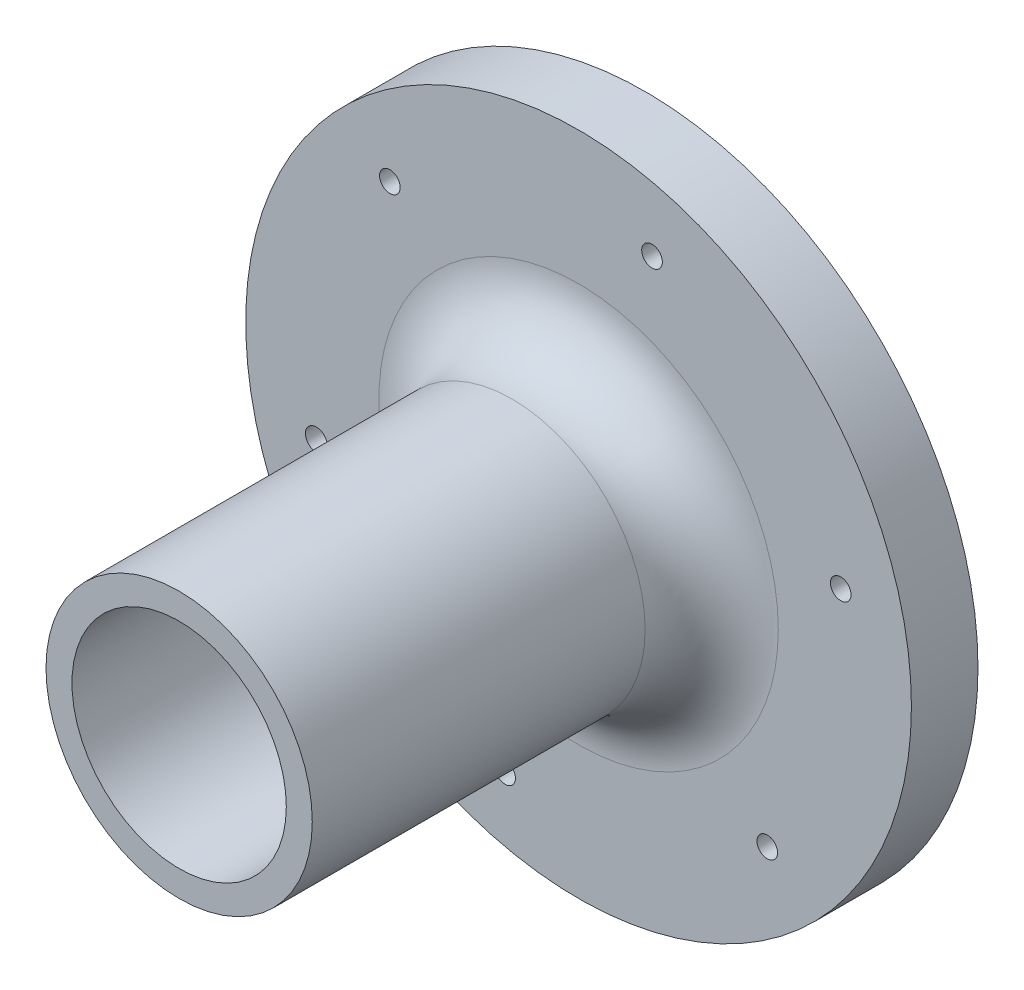
ISO-10303-21;
HEADER;
FILE_DESCRIPTION(('STEP AP214'),'2;1');
FILE_NAME('part.step','',(''),(''),'','','');
FILE_SCHEMA(('AUTOMOTIVE_DESIGN { 1 0 10303 214 1 1 1 1 }'));
ENDSEC;
DATA;
#1=APPLICATION_CONTEXT('core data for automotive mechanical design processes');
#2=APPLICATION_PROTOCOL_DEFINITION('international standard','automotive_design',2000,#1);
#3=PRODUCT_CONTEXT('',#1,'mechanical');
#4=PRODUCT('Part','Part','',(#3));
#5=PRODUCT_RELATED_PRODUCT_CATEGORY('part','',(#4));
#6=PRODUCT_DEFINITION_FORMATION('','',#4);
#7=PRODUCT_DEFINITION_CONTEXT('part definition',#1,'design');
#8=PRODUCT_DEFINITION('design','',#6,#7);
#9=PRODUCT_DEFINITION_SHAPE('','',#8);
#10=(LENGTH_UNIT() NAMED_UNIT(*) SI_UNIT(.MILLI.,.METRE.));
#11=(NAMED_UNIT(*) PLANE_ANGLE_UNIT() SI_UNIT($,.RADIAN.));
#12=(NAMED_UNIT(*) SI_UNIT($,.STERADIAN.) SOLID_ANGLE_UNIT());
#13=UNCERTAINTY_MEASURE_WITH_UNIT(LENGTH_MEASURE(1.E-05),#10,'distance_accuracy_value','');
#14=(GEOMETRIC_REPRESENTATION_CONTEXT(3) GLOBAL_UNCERTAINTY_ASSIGNED_CONTEXT((#13)) GLOBAL_UNIT_ASSIGNED_CONTEXT((#10,
#11,#12)) REPRESENTATION_CONTEXT('',''));
#15=CARTESIAN_POINT('',(0.,0.,0.));
#16=DIRECTION('',(0.,0.,1.));
#17=DIRECTION('',(1.,0.,0.));
#18=AXIS2_PLACEMENT_3D('',#15,#16,#17);
#19=CARTESIAN_POINT('',(0.,0.,10.));
#20=DIRECTION('',(0.,0.,1.));
#21=DIRECTION('',(1.,0.,0.));
#22=AXIS2_PLACEMENT_3D('',#19,#20,#21);
#23=PLANE('',#22);
#24=CARTESIAN_POINT('',(0.,0.,10.));
#25=DIRECTION('',(0.,0.,1.));
#26=DIRECTION('',(1.,0.,0.));
#27=AXIS2_PLACEMENT_3D('',#24,#25,#26);
#28=CIRCLE('',#27,30.);
#29=CARTESIAN_POINT('',(30.,0.,10.));
#30=VERTEX_POINT('',#29);
#31=EDGE_CURVE('E10',#30,#30,#28,.F.);
#32=ORIENTED_EDGE('',*,*,#31,.T.);
#33=EDGE_LOOP('',(#32));
#34=FACE_BOUND('',#33,.T.);
#35=CARTESIAN_POINT('',(39.3771859808202,9.99342156005784,10.));
#36=DIRECTION('',(0.,0.,1.));
#37=DIRECTION('',(1.,0.,0.));
#38=AXIS2_PLACEMENT_3D('',#35,#36,#37);
#39=CIRCLE('',#38,1.54999999999999);
#40=CARTESIAN_POINT('',(40.9271859808202,9.99342156005784,10.));
#41=VERTEX_POINT('',#40);
#42=EDGE_CURVE('E82',#41,#41,#39,.T.);
#43=ORIENTED_EDGE('',*,*,#42,.F.);
#44=EDGE_LOOP('',(#43));
#45=FACE_BOUND('',#44,.T.);
#46=CARTESIAN_POINT('',(-28.3431499322452,29.1049326089431,10.));
#47=DIRECTION('',(0.,0.,1.));
#48=DIRECTION('',(1.,0.,0.));
#49=AXIS2_PLACEMENT_3D('',#46,#47,#48);
#50=CIRCLE('',#49,1.55);
#51=CARTESIAN_POINT('',(-26.7931499322452,29.1049326089431,10.));
#52=VERTEX_POINT('',#51);
#53=EDGE_CURVE('E70',#52,#52,#50,.T.);
#54=ORIENTED_EDGE('',*,*,#53,.F.);
#55=EDGE_LOOP('',(#54));
#56=FACE_BOUND('',#55,.T.);
#57=CARTESIAN_POINT('',(0.,0.,10.));
#58=DIRECTION('',(0.,0.,1.));
#59=DIRECTION('',(1.,0.,0.));
#60=AXIS2_PLACEMENT_3D('',#57,#58,#59);
#61=CIRCLE('',#60,50.);
#62=CARTESIAN_POINT('',(50.,0.,10.));
#63=VERTEX_POINT('',#62);
#64=EDGE_CURVE('E48',#63,#63,#61,.T.);
#65=ORIENTED_EDGE('',*,*,#64,.T.);
#66=EDGE_LOOP('',(#65));
#67=FACE_BOUND('',#66,.T.);
#68=CARTESIAN_POINT('',(-39.3771859808798,-9.9934215600678,10.));
#69=DIRECTION('',(0.,0.,1.));
#70=DIRECTION('',(1.,0.,0.));
#71=AXIS2_PLACEMENT_3D('',#68,#69,#70);
#72=CIRCLE('',#71,1.64952832415319);
#73=CARTESIAN_POINT('',(-37.7276576567266,-9.9934215600678,10.));
#74=VERTEX_POINT('',#73);
#75=EDGE_CURVE('E56',#74,#74,#72,.T.);
#76=ORIENTED_EDGE('',*,*,#75,.F.);
#77=EDGE_LOOP('',(#76));
#78=FACE_BOUND('',#77,.T.);
#79=CARTESIAN_POINT('',(-11.0340360486944,-39.0983541690206,10.));
#80=DIRECTION('',(0.,0.,1.));
#81=DIRECTION('',(1.,0.,0.));
#82=AXIS2_PLACEMENT_3D('',#79,#80,#81);
#83=CIRCLE('',#82,1.54999999999999);
#84=CARTESIAN_POINT('',(-9.4840360486944,-39.0983541690206,10.));
#85=VERTEX_POINT('',#84);
#86=EDGE_CURVE('E66',#85,#85,#83,.T.);
#87=ORIENTED_EDGE('',*,*,#86,.F.);
#88=EDGE_LOOP('',(#87));
#89=FACE_BOUND('',#88,.T.);
#90=CARTESIAN_POINT('',(11.0340360486347,39.0983541690105,10.));
#91=DIRECTION('',(0.,0.,1.));
#92=DIRECTION('',(1.,0.,0.));
#93=AXIS2_PLACEMENT_3D('',#90,#91,#92);
#94=CIRCLE('',#93,1.55000000000001);
#95=CARTESIAN_POINT('',(12.5840360486347,39.0983541690105,10.));
#96=VERTEX_POINT('',#95);
#97=EDGE_CURVE('E76',#96,#96,#94,.T.);
#98=ORIENTED_EDGE('',*,*,#97,.F.);
#99=EDGE_LOOP('',(#98));
#100=FACE_BOUND('',#99,.T.);
#101=CARTESIAN_POINT('',(28.3431499321852,-29.1049326089529,10.));
#102=DIRECTION('',(0.,0.,1.));
#103=DIRECTION('',(1.,0.,0.));
#104=AXIS2_PLACEMENT_3D('',#101,#102,#103);
#105=CIRCLE('',#104,1.55000000000002);
#106=CARTESIAN_POINT('',(29.8931499321852,-29.1049326089529,10.));
#107=VERTEX_POINT('',#106);
#108=EDGE_CURVE('E88',#107,#107,#105,.T.);
#109=ORIENTED_EDGE('',*,*,#108,.F.);
#110=EDGE_LOOP('',(#109));
#111=FACE_BOUND('',#110,.T.);
#112=ADVANCED_FACE('F37',(#34,#45,#56,#67,#78,#89,#100,#111),#23,.T.);
#113=CARTESIAN_POINT('',(0.,0.,0.));
#114=DIRECTION('',(0.,0.,1.));
#115=DIRECTION('',(1.,0.,0.));
#116=AXIS2_PLACEMENT_3D('',#113,#114,#115);
#117=PLANE('',#116);
#118=CARTESIAN_POINT('',(0.,0.,0.));
#119=DIRECTION('',(0.,0.,1.));
#120=DIRECTION('',(1.,0.,0.));
#121=AXIS2_PLACEMENT_3D('',#118,#119,#120);
#122=CIRCLE('',#121,50.);
#123=CARTESIAN_POINT('',(50.,0.,0.));
#124=VERTEX_POINT('',#123);
#125=EDGE_CURVE('E52',#124,#124,#122,.T.);
#126=ORIENTED_EDGE('',*,*,#125,.F.);
#127=EDGE_LOOP('',(#126));
#128=FACE_BOUND('',#127,.T.);
#129=CARTESIAN_POINT('',(-39.3771859808798,-9.9934215600678,0.));
#130=DIRECTION('',(0.,0.,1.));
#131=DIRECTION('',(1.,0.,0.));
#132=AXIS2_PLACEMENT_3D('',#129,#130,#131);
#133=CIRCLE('',#132,1.64952832415319);
#134=CARTESIAN_POINT('',(-37.7276576567266,-9.9934215600678,0.));
#135=VERTEX_POINT('',#134);
#136=EDGE_CURVE('E58',#135,#135,#133,.T.);
#137=ORIENTED_EDGE('',*,*,#136,.T.);
#138=EDGE_LOOP('',(#137));
#139=FACE_BOUND('',#138,.T.);
#140=CARTESIAN_POINT('',(0.,0.,0.));
#141=DIRECTION('',(0.,0.,1.));
#142=DIRECTION('',(1.,0.,0.));
#143=AXIS2_PLACEMENT_3D('',#140,#141,#142);
#144=CIRCLE('',#143,16.5);
#145=CARTESIAN_POINT('',(16.5,0.,0.));
#146=VERTEX_POINT('',#145);
#147=EDGE_CURVE('E61',#146,#146,#144,.T.);
#148=ORIENTED_EDGE('',*,*,#147,.T.);
#149=EDGE_LOOP('',(#148));
#150=FACE_BOUND('',#149,.T.);
#151=CARTESIAN_POINT('',(-11.0340360486944,-39.0983541690206,0.));
#152=DIRECTION('',(0.,0.,1.));
#153=DIRECTION('',(1.,0.,0.));
#154=AXIS2_PLACEMENT_3D('',#151,#152,#153);
#155=CIRCLE('',#154,1.54999999999999);
#156=CARTESIAN_POINT('',(-9.4840360486944,-39.0983541690206,0.));
#157=VERTEX_POINT('',#156);
#158=EDGE_CURVE('E67',#157,#157,#155,.T.);
#159=ORIENTED_EDGE('',*,*,#158,.T.);
#160=EDGE_LOOP('',(#159));
#161=FACE_BOUND('',#160,.T.);
#162=CARTESIAN_POINT('',(-28.3431499322452,29.1049326089431,0.));
#163=DIRECTION('',(0.,0.,1.));
#164=DIRECTION('',(1.,0.,0.));
#165=AXIS2_PLACEMENT_3D('',#162,#163,#164);
#166=CIRCLE('',#165,1.55);
#167=CARTESIAN_POINT('',(-26.7931499322452,29.1049326089431,0.));
#168=VERTEX_POINT('',#167);
#169=EDGE_CURVE('E73',#168,#168,#166,.T.);
#170=ORIENTED_EDGE('',*,*,#169,.T.);
#171=EDGE_LOOP('',(#170));
#172=FACE_BOUND('',#171,.T.);
#173=CARTESIAN_POINT('',(11.0340360486347,39.0983541690105,0.));
#174=DIRECTION('',(0.,0.,1.));
#175=DIRECTION('',(1.,0.,0.));
#176=AXIS2_PLACEMENT_3D('',#173,#174,#175);
#177=CIRCLE('',#176,1.55000000000001);
#178=CARTESIAN_POINT('',(12.5840360486347,39.0983541690105,0.));
#179=VERTEX_POINT('',#178);
#180=EDGE_CURVE('E79',#179,#179,#177,.T.);
#181=ORIENTED_EDGE('',*,*,#180,.T.);
#182=EDGE_LOOP('',(#181));
#183=FACE_BOUND('',#182,.T.);
#184=CARTESIAN_POINT('',(39.3771859808202,9.99342156005784,0.));
#185=DIRECTION('',(0.,0.,1.));
#186=DIRECTION('',(1.,0.,0.));
#187=AXIS2_PLACEMENT_3D('',#184,#185,#186);
#188=CIRCLE('',#187,1.54999999999999);
#189=CARTESIAN_POINT('',(40.9271859808202,9.99342156005784,0.));
#190=VERTEX_POINT('',#189);
#191=EDGE_CURVE('E85',#190,#190,#188,.T.);
#192=ORIENTED_EDGE('',*,*,#191,.T.);
#193=EDGE_LOOP('',(#192));
#194=FACE_BOUND('',#193,.T.);
#195=CARTESIAN_POINT('',(28.3431499321852,-29.1049326089529,0.));
#196=DIRECTION('',(0.,0.,1.));
#197=DIRECTION('',(1.,0.,0.));
#198=AXIS2_PLACEMENT_3D('',#195,#196,#197);
#199=CIRCLE('',#198,1.55000000000002);
#200=CARTESIAN_POINT('',(29.8931499321852,-29.1049326089529,0.));
#201=VERTEX_POINT('',#200);
#202=EDGE_CURVE('E91',#201,#201,#199,.T.);
#203=ORIENTED_EDGE('',*,*,#202,.T.);
#204=EDGE_LOOP('',(#203));
#205=FACE_BOUND('',#204,.T.);
#206=ADVANCED_FACE('F129',(#128,#139,#150,#161,#172,#183,#194,#205),#117,.F.);
#207=CARTESIAN_POINT('',(0.,0.,10.));
#208=DIRECTION('',(0.,0.,-1.));
#209=DIRECTION('',(-1.,0.,0.));
#210=AXIS2_PLACEMENT_3D('',#207,#208,#209);
#211=CYLINDRICAL_SURFACE('',#210,50.);
#212=ORIENTED_EDGE('',*,*,#64,.F.);
#213=EDGE_LOOP('',(#212));
#214=FACE_BOUND('',#213,.T.);
#215=ORIENTED_EDGE('',*,*,#125,.T.);
#216=EDGE_LOOP('',(#215));
#217=FACE_BOUND('',#216,.T.);
#218=ADVANCED_FACE('F134',(#214,#217),#211,.T.);
#219=CARTESIAN_POINT('',(-39.3771859808798,-9.9934215600678,10.));
#220=DIRECTION('',(0.,0.,-1.));
#221=DIRECTION('',(-1.,0.,0.));
#222=AXIS2_PLACEMENT_3D('',#219,#220,#221);
#223=CYLINDRICAL_SURFACE('',#222,1.64952832415319);
#224=ORIENTED_EDGE('',*,*,#75,.T.);
#225=EDGE_LOOP('',(#224));
#226=FACE_BOUND('',#225,.T.);
#227=ORIENTED_EDGE('',*,*,#136,.F.);
#228=EDGE_LOOP('',(#227));
#229=FACE_BOUND('',#228,.T.);
#230=ADVANCED_FACE('F139',(#226,#229),#223,.F.);
#231=CARTESIAN_POINT('',(0.,0.,10.));
#232=DIRECTION('',(0.,0.,-1.));
#233=DIRECTION('',(-1.,0.,0.));
#234=AXIS2_PLACEMENT_3D('',#231,#232,#233);
#235=CYLINDRICAL_SURFACE('',#234,16.5);
#236=CARTESIAN_POINT('',(0.,0.,10.));
#237=DIRECTION('',(0.,0.,1.));
#238=DIRECTION('',(1.,0.,0.));
#239=AXIS2_PLACEMENT_3D('',#236,#237,#238);
#240=CIRCLE('',#239,16.5);
#241=CARTESIAN_POINT('',(16.5,0.,10.));
#242=VERTEX_POINT('',#241);
#243=EDGE_CURVE('E94',#242,#242,#240,.T.);
#244=ORIENTED_EDGE('',*,*,#243,.T.);
#245=EDGE_LOOP('',(#244));
#246=FACE_BOUND('',#245,.T.);
#247=ORIENTED_EDGE('',*,*,#147,.F.);
#248=EDGE_LOOP('',(#247));
#249=FACE_BOUND('',#248,.T.);
#250=ADVANCED_FACE('F146',(#246,#249),#235,.F.);
#251=CARTESIAN_POINT('',(-11.0340360486944,-39.0983541690206,10.));
#252=DIRECTION('',(0.,0.,-1.));
#253=DIRECTION('',(-1.,0.,0.));
#254=AXIS2_PLACEMENT_3D('',#251,#252,#253);
#255=CYLINDRICAL_SURFACE('',#254,1.54999999999999);
#256=ORIENTED_EDGE('',*,*,#86,.T.);
#257=EDGE_LOOP('',(#256));
#258=FACE_BOUND('',#257,.T.);
#259=ORIENTED_EDGE('',*,*,#158,.F.);
#260=EDGE_LOOP('',(#259));
#261=FACE_BOUND('',#260,.T.);
#262=ADVANCED_FACE('F183',(#258,#261),#255,.F.);
#263=CARTESIAN_POINT('',(-28.3431499322452,29.1049326089431,10.));
#264=DIRECTION('',(0.,0.,-1.));
#265=DIRECTION('',(-1.,0.,0.));
#266=AXIS2_PLACEMENT_3D('',#263,#264,#265);
#267=CYLINDRICAL_SURFACE('',#266,1.55);
#268=ORIENTED_EDGE('',*,*,#53,.T.);
#269=EDGE_LOOP('',(#268));
#270=FACE_BOUND('',#269,.T.);
#271=ORIENTED_EDGE('',*,*,#169,.F.);
#272=EDGE_LOOP('',(#271));
#273=FACE_BOUND('',#272,.T.);
#274=ADVANCED_FACE('F179',(#270,#273),#267,.F.);
#275=CARTESIAN_POINT('',(11.0340360486347,39.0983541690105,10.));
#276=DIRECTION('',(0.,0.,-1.));
#277=DIRECTION('',(-1.,0.,0.));
#278=AXIS2_PLACEMENT_3D('',#275,#276,#277);
#279=CYLINDRICAL_SURFACE('',#278,1.55000000000001);
#280=ORIENTED_EDGE('',*,*,#97,.T.);
#281=EDGE_LOOP('',(#280));
#282=FACE_BOUND('',#281,.T.);
#283=ORIENTED_EDGE('',*,*,#180,.F.);
#284=EDGE_LOOP('',(#283));
#285=FACE_BOUND('',#284,.T.);
#286=ADVANCED_FACE('F173',(#282,#285),#279,.F.);
#287=CARTESIAN_POINT('',(39.3771859808202,9.99342156005784,10.));
#288=DIRECTION('',(0.,0.,-1.));
#289=DIRECTION('',(-1.,0.,0.));
#290=AXIS2_PLACEMENT_3D('',#287,#288,#289);
#291=CYLINDRICAL_SURFACE('',#290,1.54999999999999);
#292=ORIENTED_EDGE('',*,*,#42,.T.);
#293=EDGE_LOOP('',(#292));
#294=FACE_BOUND('',#293,.T.);
#295=ORIENTED_EDGE('',*,*,#191,.F.);
#296=EDGE_LOOP('',(#295));
#297=FACE_BOUND('',#296,.T.);
#298=ADVANCED_FACE('F167',(#294,#297),#291,.F.);
#299=CARTESIAN_POINT('',(28.3431499321852,-29.1049326089529,10.));
#300=DIRECTION('',(0.,0.,-1.));
#301=DIRECTION('',(-1.,0.,0.));
#302=AXIS2_PLACEMENT_3D('',#299,#300,#301);
#303=CYLINDRICAL_SURFACE('',#302,1.55000000000002);
#304=ORIENTED_EDGE('',*,*,#108,.T.);
#305=EDGE_LOOP('',(#304));
#306=FACE_BOUND('',#305,.T.);
#307=ORIENTED_EDGE('',*,*,#202,.F.);
#308=EDGE_LOOP('',(#307));
#309=FACE_BOUND('',#308,.T.);
#310=ADVANCED_FACE('F124',(#306,#309),#303,.F.);
#311=CARTESIAN_POINT('',(0.,0.,10.));
#312=DIRECTION('',(0.,0.,1.));
#313=DIRECTION('',(1.,0.,0.));
#314=AXIS2_PLACEMENT_3D('',#311,#312,#313);
#315=PLANE('',#314);
#316=CARTESIAN_POINT('',(0.,0.,10.));
#317=DIRECTION('',(0.,0.,1.));
#318=DIRECTION('',(1.,0.,0.));
#319=AXIS2_PLACEMENT_3D('',#316,#317,#318);
#320=CIRCLE('',#319,16.1);
#321=CARTESIAN_POINT('',(16.1,0.,10.));
#322=VERTEX_POINT('',#321);
#323=EDGE_CURVE('E103',#322,#322,#320,.T.);
#324=ORIENTED_EDGE('',*,*,#323,.T.);
#325=EDGE_LOOP('',(#324));
#326=FACE_BOUND('',#325,.T.);
#327=ORIENTED_EDGE('',*,*,#243,.F.);
#328=EDGE_LOOP('',(#327));
#329=FACE_BOUND('',#328,.T.);
#330=ADVANCED_FACE('F115',(#326,#329),#315,.F.);
#331=CARTESIAN_POINT('',(0.,0.,70.));
#332=DIRECTION('',(0.,0.,1.));
#333=DIRECTION('',(1.,0.,0.));
#334=AXIS2_PLACEMENT_3D('',#331,#332,#333);
#335=PLANE('',#334);
#336=CARTESIAN_POINT('',(0.,0.,70.));
#337=DIRECTION('',(0.,0.,1.));
#338=DIRECTION('',(1.,0.,0.));
#339=AXIS2_PLACEMENT_3D('',#336,#337,#338);
#340=CIRCLE('',#339,20.);
#341=CARTESIAN_POINT('',(20.,0.,70.));
#342=VERTEX_POINT('',#341);
#343=EDGE_CURVE('E99',#342,#342,#340,.T.);
#344=ORIENTED_EDGE('',*,*,#343,.T.);
#345=EDGE_LOOP('',(#344));
#346=FACE_BOUND('',#345,.T.);
#347=CARTESIAN_POINT('',(0.,0.,70.));
#348=DIRECTION('',(0.,0.,1.));
#349=DIRECTION('',(1.,0.,0.));
#350=AXIS2_PLACEMENT_3D('',#347,#348,#349);
#351=CIRCLE('',#350,16.1);
#352=CARTESIAN_POINT('',(16.1,0.,70.));
#353=VERTEX_POINT('',#352);
#354=EDGE_CURVE('E102',#353,#353,#351,.T.);
#355=ORIENTED_EDGE('',*,*,#354,.F.);
#356=EDGE_LOOP('',(#355));
#357=FACE_BOUND('',#356,.T.);
#358=ADVANCED_FACE('F112',(#346,#357),#335,.T.);
#359=CARTESIAN_POINT('',(0.,0.,70.));
#360=DIRECTION('',(0.,0.,-1.));
#361=DIRECTION('',(-1.,0.,0.));
#362=AXIS2_PLACEMENT_3D('',#359,#360,#361);
#363=CYLINDRICAL_SURFACE('',#362,20.);
#364=CARTESIAN_POINT('',(0.,0.,20.));
#365=DIRECTION('',(0.,0.,1.));
#366=DIRECTION('',(1.,0.,0.));
#367=AXIS2_PLACEMENT_3D('',#364,#365,#366);
#368=CIRCLE('',#367,20.);
#369=CARTESIAN_POINT('',(20.,0.,20.));
#370=VERTEX_POINT('',#369);
#371=EDGE_CURVE('E44',#370,#370,#368,.T.);
#372=ORIENTED_EDGE('',*,*,#371,.T.);
#373=EDGE_LOOP('',(#372));
#374=FACE_BOUND('',#373,.T.);
#375=ORIENTED_EDGE('',*,*,#343,.F.);
#376=EDGE_LOOP('',(#375));
#377=FACE_BOUND('',#376,.T.);
#378=ADVANCED_FACE('F114',(#374,#377),#363,.T.);
#379=CARTESIAN_POINT('',(0.,0.,70.));
#380=DIRECTION('',(0.,0.,-1.));
#381=DIRECTION('',(-1.,0.,0.));
#382=AXIS2_PLACEMENT_3D('',#379,#380,#381);
#383=CYLINDRICAL_SURFACE('',#382,16.1);
#384=ORIENTED_EDGE('',*,*,#354,.T.);
#385=EDGE_LOOP('',(#384));
#386=FACE_BOUND('',#385,.T.);
#387=ORIENTED_EDGE('',*,*,#323,.F.);
#388=EDGE_LOOP('',(#387));
#389=FACE_BOUND('',#388,.T.);
#390=ADVANCED_FACE('F109',(#386,#389),#383,.F.);
#391=CARTESIAN_POINT('',(0.,0.,20.));
#392=DIRECTION('',(0.,0.,1.));
#393=DIRECTION('',(1.,0.,0.));
#394=AXIS2_PLACEMENT_3D('',#391,#392,#393);
#395=TOROIDAL_SURFACE('',#394,30.,10.);
#396=ORIENTED_EDGE('',*,*,#31,.F.);
#397=EDGE_LOOP('',(#396));
#398=FACE_BOUND('',#397,.T.);
#399=ORIENTED_EDGE('',*,*,#371,.F.);
#400=EDGE_LOOP('',(#399));
#401=FACE_BOUND('',#400,.T.);
#402=ADVANCED_FACE('F39',(#398,#401),#395,.F.);
#403=CLOSED_SHELL('',(#112,#206,#218,#230,#250,#262,#274,#286,#298,#310,#330,#358,#378,#390,#402));
#404=MANIFOLD_SOLID_BREP('B2',#403);
#405=ADVANCED_BREP_SHAPE_REPRESENTATION('',(#18,#404),#14);
#406=SHAPE_DEFINITION_REPRESENTATION(#9,#405);
ENDSEC;
END-ISO-10303-21;
